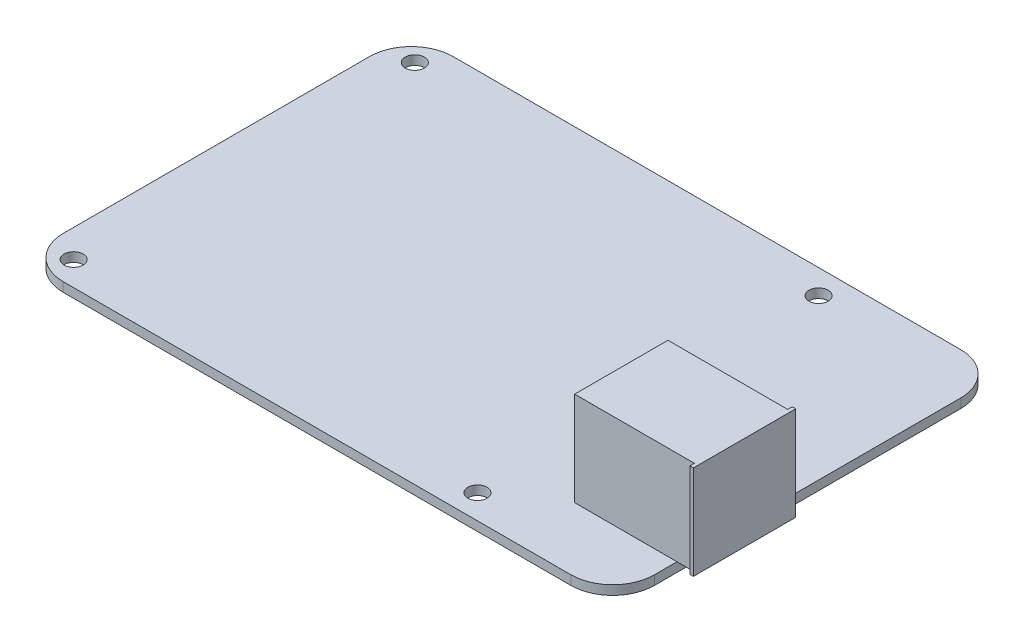
ISO-10303-21;
HEADER;
FILE_DESCRIPTION(('STEP AP214'),'2;1');
FILE_NAME('part.step','',(''),(''),'','','');
FILE_SCHEMA(('AUTOMOTIVE_DESIGN { 1 0 10303 214 1 1 1 1 }'));
ENDSEC;
DATA;
#1=APPLICATION_CONTEXT('core data for automotive mechanical design processes');
#2=APPLICATION_PROTOCOL_DEFINITION('international standard','automotive_design',2000,#1);
#3=PRODUCT_CONTEXT('',#1,'mechanical');
#4=PRODUCT('Part','Part','',(#3));
#5=PRODUCT_RELATED_PRODUCT_CATEGORY('part','',(#4));
#6=PRODUCT_DEFINITION_FORMATION('','',#4);
#7=PRODUCT_DEFINITION_CONTEXT('part definition',#1,'design');
#8=PRODUCT_DEFINITION('design','',#6,#7);
#9=PRODUCT_DEFINITION_SHAPE('','',#8);
#10=(LENGTH_UNIT() NAMED_UNIT(*) SI_UNIT(.MILLI.,.METRE.));
#11=(NAMED_UNIT(*) PLANE_ANGLE_UNIT() SI_UNIT($,.RADIAN.));
#12=(NAMED_UNIT(*) SI_UNIT($,.STERADIAN.) SOLID_ANGLE_UNIT());
#13=UNCERTAINTY_MEASURE_WITH_UNIT(LENGTH_MEASURE(1.E-05),#10,'distance_accuracy_value','');
#14=(GEOMETRIC_REPRESENTATION_CONTEXT(3) GLOBAL_UNCERTAINTY_ASSIGNED_CONTEXT((#13)) GLOBAL_UNIT_ASSIGNED_CONTEXT((#10,
#11,#12)) REPRESENTATION_CONTEXT('',''));
#15=CARTESIAN_POINT('',(0.,0.,0.));
#16=DIRECTION('',(0.,0.,1.));
#17=DIRECTION('',(1.,0.,0.));
#18=AXIS2_PLACEMENT_3D('',#15,#16,#17);
#19=CARTESIAN_POINT('',(42.46,1.33,-28.));
#20=DIRECTION('',(-1.,0.,0.));
#21=DIRECTION('',(0.,0.,1.));
#22=AXIS2_PLACEMENT_3D('',#19,#20,#21);
#23=PLANE('',#22);
#24=DIRECTION('',(0.,0.,-1.));
#25=VECTOR('',#24,1.);
#26=CARTESIAN_POINT('',(42.46,0.,-28.));
#27=LINE('',#26,#25);
#28=CARTESIAN_POINT('',(42.46,0.,22.));
#29=VERTEX_POINT('',#28);
#30=CARTESIAN_POINT('',(42.46,0.,-22.));
#31=VERTEX_POINT('',#30);
#32=EDGE_CURVE('E205',#29,#31,#27,.T.);
#33=ORIENTED_EDGE('',*,*,#32,.T.);
#34=DIRECTION('',(0.,-1.,0.));
#35=VECTOR('',#34,1.);
#36=CARTESIAN_POINT('',(42.46,1.33,-22.));
#37=LINE('',#36,#35);
#38=CARTESIAN_POINT('',(42.46,1.33,-22.));
#39=VERTEX_POINT('',#38);
#40=EDGE_CURVE('E248',#31,#39,#37,.F.);
#41=ORIENTED_EDGE('',*,*,#40,.T.);
#42=DIRECTION('',(0.,0.,-1.));
#43=VECTOR('',#42,1.);
#44=CARTESIAN_POINT('',(42.46,1.33,-28.));
#45=LINE('',#44,#43);
#46=CARTESIAN_POINT('',(42.46,1.33,5.36205839241151));
#47=VERTEX_POINT('',#46);
#48=EDGE_CURVE('E212',#47,#39,#45,.T.);
#49=ORIENTED_EDGE('',*,*,#48,.F.);
#50=CARTESIAN_POINT('',(42.46,1.33,18.7620583924115));
#51=VERTEX_POINT('',#50);
#52=EDGE_CURVE('E211',#51,#47,#45,.T.);
#53=ORIENTED_EDGE('',*,*,#52,.F.);
#54=CARTESIAN_POINT('',(42.46,1.33,22.));
#55=VERTEX_POINT('',#54);
#56=EDGE_CURVE('E208',#55,#51,#45,.T.);
#57=ORIENTED_EDGE('',*,*,#56,.F.);
#58=DIRECTION('',(0.,-1.,0.));
#59=VECTOR('',#58,1.);
#60=CARTESIAN_POINT('',(42.46,1.33,22.));
#61=LINE('',#60,#59);
#62=EDGE_CURVE('E245',#55,#29,#61,.T.);
#63=ORIENTED_EDGE('',*,*,#62,.T.);
#64=EDGE_LOOP('',(#33,#41,#49,#53,#57,#63));
#65=FACE_BOUND('',#64,.T.);
#66=ADVANCED_FACE('F33',(#65),#23,.F.);
#67=CARTESIAN_POINT('',(-42.46,1.33,-28.));
#68=DIRECTION('',(0.,0.,1.));
#69=DIRECTION('',(1.,0.,0.));
#70=AXIS2_PLACEMENT_3D('',#67,#68,#69);
#71=PLANE('',#70);
#72=DIRECTION('',(-1.,0.,0.));
#73=VECTOR('',#72,1.);
#74=CARTESIAN_POINT('',(-42.46,1.33,-28.));
#75=LINE('',#74,#73);
#76=CARTESIAN_POINT('',(36.46,1.33,-28.));
#77=VERTEX_POINT('',#76);
#78=CARTESIAN_POINT('',(-36.46,1.33,-28.));
#79=VERTEX_POINT('',#78);
#80=EDGE_CURVE('E210',#77,#79,#75,.T.);
#81=ORIENTED_EDGE('',*,*,#80,.F.);
#82=DIRECTION('',(0.,-1.,0.));
#83=VECTOR('',#82,1.);
#84=CARTESIAN_POINT('',(36.46,1.33,-28.));
#85=LINE('',#84,#83);
#86=CARTESIAN_POINT('',(36.46,0.,-28.));
#87=VERTEX_POINT('',#86);
#88=EDGE_CURVE('E234',#77,#87,#85,.T.);
#89=ORIENTED_EDGE('',*,*,#88,.T.);
#90=DIRECTION('',(-1.,0.,0.));
#91=VECTOR('',#90,1.);
#92=CARTESIAN_POINT('',(-42.46,0.,-28.));
#93=LINE('',#92,#91);
#94=CARTESIAN_POINT('',(-36.46,0.,-28.));
#95=VERTEX_POINT('',#94);
#96=EDGE_CURVE('E224',#87,#95,#93,.T.);
#97=ORIENTED_EDGE('',*,*,#96,.T.);
#98=DIRECTION('',(0.,-1.,0.));
#99=VECTOR('',#98,1.);
#100=CARTESIAN_POINT('',(-36.46,1.33,-28.));
#101=LINE('',#100,#99);
#102=EDGE_CURVE('E221',#95,#79,#101,.F.);
#103=ORIENTED_EDGE('',*,*,#102,.T.);
#104=EDGE_LOOP('',(#81,#89,#97,#103));
#105=FACE_BOUND('',#104,.T.);
#106=ADVANCED_FACE('F300',(#105),#71,.F.);
#107=CARTESIAN_POINT('',(-42.46,1.33,-28.));
#108=DIRECTION('',(1.,0.,0.));
#109=DIRECTION('',(0.,0.,-1.));
#110=AXIS2_PLACEMENT_3D('',#107,#108,#109);
#111=PLANE('',#110);
#112=DIRECTION('',(0.,0.,1.));
#113=VECTOR('',#112,1.);
#114=CARTESIAN_POINT('',(-42.46,1.33,-28.));
#115=LINE('',#114,#113);
#116=CARTESIAN_POINT('',(-42.46,1.33,-22.));
#117=VERTEX_POINT('',#116);
#118=CARTESIAN_POINT('',(-42.46,1.33,22.));
#119=VERTEX_POINT('',#118);
#120=EDGE_CURVE('E215',#117,#119,#115,.T.);
#121=ORIENTED_EDGE('',*,*,#120,.F.);
#122=DIRECTION('',(0.,-1.,0.));
#123=VECTOR('',#122,1.);
#124=CARTESIAN_POINT('',(-42.46,1.33,-22.));
#125=LINE('',#124,#123);
#126=CARTESIAN_POINT('',(-42.46,0.,-22.));
#127=VERTEX_POINT('',#126);
#128=EDGE_CURVE('E37',#117,#127,#125,.T.);
#129=ORIENTED_EDGE('',*,*,#128,.T.);
#130=DIRECTION('',(0.,0.,1.));
#131=VECTOR('',#130,1.);
#132=CARTESIAN_POINT('',(-42.46,0.,-28.));
#133=LINE('',#132,#131);
#134=CARTESIAN_POINT('',(-42.46,0.,22.));
#135=VERTEX_POINT('',#134);
#136=EDGE_CURVE('E227',#127,#135,#133,.T.);
#137=ORIENTED_EDGE('',*,*,#136,.T.);
#138=DIRECTION('',(0.,-1.,0.));
#139=VECTOR('',#138,1.);
#140=CARTESIAN_POINT('',(-42.46,1.33,22.));
#141=LINE('',#140,#139);
#142=EDGE_CURVE('E263',#135,#119,#141,.F.);
#143=ORIENTED_EDGE('',*,*,#142,.T.);
#144=EDGE_LOOP('',(#121,#129,#137,#143));
#145=FACE_BOUND('',#144,.T.);
#146=ADVANCED_FACE('F270',(#145),#111,.F.);
#147=CARTESIAN_POINT('',(-42.46,1.33,28.));
#148=DIRECTION('',(0.,0.,-1.));
#149=DIRECTION('',(-1.,0.,0.));
#150=AXIS2_PLACEMENT_3D('',#147,#148,#149);
#151=PLANE('',#150);
#152=DIRECTION('',(1.,0.,0.));
#153=VECTOR('',#152,1.);
#154=CARTESIAN_POINT('',(-42.46,0.,28.));
#155=LINE('',#154,#153);
#156=CARTESIAN_POINT('',(-36.46,0.,28.));
#157=VERTEX_POINT('',#156);
#158=CARTESIAN_POINT('',(36.46,0.,28.));
#159=VERTEX_POINT('',#158);
#160=EDGE_CURVE('E230',#157,#159,#155,.T.);
#161=ORIENTED_EDGE('',*,*,#160,.T.);
#162=DIRECTION('',(0.,-1.,0.));
#163=VECTOR('',#162,1.);
#164=CARTESIAN_POINT('',(36.46,1.33,28.));
#165=LINE('',#164,#163);
#166=CARTESIAN_POINT('',(36.46,1.33,28.));
#167=VERTEX_POINT('',#166);
#168=EDGE_CURVE('E262',#159,#167,#165,.F.);
#169=ORIENTED_EDGE('',*,*,#168,.T.);
#170=DIRECTION('',(1.,0.,0.));
#171=VECTOR('',#170,1.);
#172=CARTESIAN_POINT('',(-42.46,1.33,28.));
#173=LINE('',#172,#171);
#174=CARTESIAN_POINT('',(-36.46,1.33,28.));
#175=VERTEX_POINT('',#174);
#176=EDGE_CURVE('E218',#175,#167,#173,.T.);
#177=ORIENTED_EDGE('',*,*,#176,.F.);
#178=DIRECTION('',(0.,-1.,0.));
#179=VECTOR('',#178,1.);
#180=CARTESIAN_POINT('',(-36.46,1.33,28.));
#181=LINE('',#180,#179);
#182=EDGE_CURVE('E259',#175,#157,#181,.T.);
#183=ORIENTED_EDGE('',*,*,#182,.T.);
#184=EDGE_LOOP('',(#161,#169,#177,#183));
#185=FACE_BOUND('',#184,.T.);
#186=ADVANCED_FACE('F282',(#185),#151,.F.);
#187=CARTESIAN_POINT('',(0.,1.33,0.));
#188=DIRECTION('',(0.,1.,0.));
#189=DIRECTION('',(0.,0.,1.));
#190=AXIS2_PLACEMENT_3D('',#187,#188,#189);
#191=PLANE('',#190);
#192=DIRECTION('',(1.,0.,0.));
#193=VECTOR('',#192,1.);
#194=CARTESIAN_POINT('',(27.76,1.33,18.7620583924115));
#195=LINE('',#194,#193);
#196=CARTESIAN_POINT('',(27.76,1.33,18.7620583924115));
#197=VERTEX_POINT('',#196);
#198=EDGE_CURVE('E50',#197,#51,#195,.T.);
#199=ORIENTED_EDGE('',*,*,#198,.F.);
#200=DIRECTION('',(0.,0.,1.));
#201=VECTOR('',#200,1.);
#202=CARTESIAN_POINT('',(27.76,1.33,5.36205839241152));
#203=LINE('',#202,#201);
#204=CARTESIAN_POINT('',(27.76,1.33,5.36205839241152));
#205=VERTEX_POINT('',#204);
#206=EDGE_CURVE('E537',#205,#197,#203,.T.);
#207=ORIENTED_EDGE('',*,*,#206,.F.);
#208=DIRECTION('',(-1.,0.,0.));
#209=VECTOR('',#208,1.);
#210=CARTESIAN_POINT('',(27.76,1.33,5.36205839241152));
#211=LINE('',#210,#209);
#212=EDGE_CURVE('E11',#47,#205,#211,.T.);
#213=ORIENTED_EDGE('',*,*,#212,.F.);
#214=ORIENTED_EDGE('',*,*,#48,.T.);
#215=CARTESIAN_POINT('',(36.46,1.33,-22.));
#216=DIRECTION('',(0.,1.,0.));
#217=DIRECTION('',(0.,0.,1.));
#218=AXIS2_PLACEMENT_3D('',#215,#216,#217);
#219=CIRCLE('',#218,6.);
#220=EDGE_CURVE('E257',#39,#77,#219,.T.);
#221=ORIENTED_EDGE('',*,*,#220,.T.);
#222=ORIENTED_EDGE('',*,*,#80,.T.);
#223=CARTESIAN_POINT('',(-36.46,1.33,-22.));
#224=DIRECTION('',(0.,1.,0.));
#225=DIRECTION('',(0.,0.,1.));
#226=AXIS2_PLACEMENT_3D('',#223,#224,#225);
#227=CIRCLE('',#226,6.);
#228=EDGE_CURVE('E253',#79,#117,#227,.T.);
#229=ORIENTED_EDGE('',*,*,#228,.T.);
#230=ORIENTED_EDGE('',*,*,#120,.T.);
#231=CARTESIAN_POINT('',(-36.46,1.33,22.));
#232=DIRECTION('',(0.,1.,0.));
#233=DIRECTION('',(0.,0.,1.));
#234=AXIS2_PLACEMENT_3D('',#231,#232,#233);
#235=CIRCLE('',#234,6.);
#236=EDGE_CURVE('E251',#119,#175,#235,.T.);
#237=ORIENTED_EDGE('',*,*,#236,.T.);
#238=ORIENTED_EDGE('',*,*,#176,.T.);
#239=CARTESIAN_POINT('',(36.46,1.33,22.));
#240=DIRECTION('',(0.,1.,0.));
#241=DIRECTION('',(0.,0.,1.));
#242=AXIS2_PLACEMENT_3D('',#239,#240,#241);
#243=CIRCLE('',#242,6.);
#244=EDGE_CURVE('E255',#167,#55,#243,.T.);
#245=ORIENTED_EDGE('',*,*,#244,.T.);
#246=ORIENTED_EDGE('',*,*,#56,.T.);
#247=EDGE_LOOP('',(#199,#207,#213,#214,#221,#222,#229,#230,#237,#238,#245,#246));
#248=FACE_BOUND('',#247,.T.);
#249=CARTESIAN_POINT('',(19.54,1.33,-24.5));
#250=DIRECTION('',(0.,1.,0.));
#251=DIRECTION('',(0.,0.,1.));
#252=AXIS2_PLACEMENT_3D('',#249,#250,#251);
#253=CIRCLE('',#252,1.375);
#254=CARTESIAN_POINT('',(19.54,1.33,-23.125));
#255=VERTEX_POINT('',#254);
#256=EDGE_CURVE('E178',#255,#255,#253,.T.);
#257=ORIENTED_EDGE('',*,*,#256,.F.);
#258=EDGE_LOOP('',(#257));
#259=FACE_BOUND('',#258,.T.);
#260=CARTESIAN_POINT('',(19.54,1.33,24.5));
#261=DIRECTION('',(0.,1.,0.));
#262=DIRECTION('',(0.,0.,1.));
#263=AXIS2_PLACEMENT_3D('',#260,#261,#262);
#264=CIRCLE('',#263,1.375);
#265=CARTESIAN_POINT('',(19.54,1.33,25.875));
#266=VERTEX_POINT('',#265);
#267=EDGE_CURVE('E188',#266,#266,#264,.T.);
#268=ORIENTED_EDGE('',*,*,#267,.F.);
#269=EDGE_LOOP('',(#268));
#270=FACE_BOUND('',#269,.T.);
#271=CARTESIAN_POINT('',(-38.46,1.33,24.5));
#272=DIRECTION('',(0.,1.,0.));
#273=DIRECTION('',(0.,0.,1.));
#274=AXIS2_PLACEMENT_3D('',#271,#272,#273);
#275=CIRCLE('',#274,1.375);
#276=CARTESIAN_POINT('',(-38.46,1.33,25.875));
#277=VERTEX_POINT('',#276);
#278=EDGE_CURVE('E193',#277,#277,#275,.T.);
#279=ORIENTED_EDGE('',*,*,#278,.F.);
#280=EDGE_LOOP('',(#279));
#281=FACE_BOUND('',#280,.T.);
#282=CARTESIAN_POINT('',(-38.46,1.33,-24.5));
#283=DIRECTION('',(0.,1.,0.));
#284=DIRECTION('',(0.,0.,1.));
#285=AXIS2_PLACEMENT_3D('',#282,#283,#284);
#286=CIRCLE('',#285,1.375);
#287=CARTESIAN_POINT('',(-38.46,1.33,-23.125));
#288=VERTEX_POINT('',#287);
#289=EDGE_CURVE('E199',#288,#288,#286,.T.);
#290=ORIENTED_EDGE('',*,*,#289,.F.);
#291=EDGE_LOOP('',(#290));
#292=FACE_BOUND('',#291,.T.);
#293=ADVANCED_FACE('F285',(#248,#259,#270,#281,#292),#191,.T.);
#294=CARTESIAN_POINT('',(0.,0.,0.));
#295=DIRECTION('',(0.,1.,0.));
#296=DIRECTION('',(0.,0.,1.));
#297=AXIS2_PLACEMENT_3D('',#294,#295,#296);
#298=PLANE('',#297);
#299=CARTESIAN_POINT('',(19.54,0.,-24.5));
#300=DIRECTION('',(0.,1.,0.));
#301=DIRECTION('',(0.,0.,1.));
#302=AXIS2_PLACEMENT_3D('',#299,#300,#301);
#303=CIRCLE('',#302,1.375);
#304=CARTESIAN_POINT('',(19.54,0.,-23.125));
#305=VERTEX_POINT('',#304);
#306=EDGE_CURVE('E181',#305,#305,#303,.T.);
#307=ORIENTED_EDGE('',*,*,#306,.T.);
#308=EDGE_LOOP('',(#307));
#309=FACE_BOUND('',#308,.T.);
#310=CARTESIAN_POINT('',(19.54,0.,24.5));
#311=DIRECTION('',(0.,1.,0.));
#312=DIRECTION('',(0.,0.,1.));
#313=AXIS2_PLACEMENT_3D('',#310,#311,#312);
#314=CIRCLE('',#313,1.375);
#315=CARTESIAN_POINT('',(19.54,0.,25.875));
#316=VERTEX_POINT('',#315);
#317=EDGE_CURVE('E190',#316,#316,#314,.T.);
#318=ORIENTED_EDGE('',*,*,#317,.T.);
#319=EDGE_LOOP('',(#318));
#320=FACE_BOUND('',#319,.T.);
#321=CARTESIAN_POINT('',(-38.46,0.,24.5));
#322=DIRECTION('',(0.,1.,0.));
#323=DIRECTION('',(0.,0.,1.));
#324=AXIS2_PLACEMENT_3D('',#321,#322,#323);
#325=CIRCLE('',#324,1.375);
#326=CARTESIAN_POINT('',(-38.46,0.,25.875));
#327=VERTEX_POINT('',#326);
#328=EDGE_CURVE('E196',#327,#327,#325,.T.);
#329=ORIENTED_EDGE('',*,*,#328,.T.);
#330=EDGE_LOOP('',(#329));
#331=FACE_BOUND('',#330,.T.);
#332=CARTESIAN_POINT('',(-38.46,0.,-24.5));
#333=DIRECTION('',(0.,1.,0.));
#334=DIRECTION('',(0.,0.,1.));
#335=AXIS2_PLACEMENT_3D('',#332,#333,#334);
#336=CIRCLE('',#335,1.375);
#337=CARTESIAN_POINT('',(-38.46,0.,-23.125));
#338=VERTEX_POINT('',#337);
#339=EDGE_CURVE('E202',#338,#338,#336,.T.);
#340=ORIENTED_EDGE('',*,*,#339,.T.);
#341=EDGE_LOOP('',(#340));
#342=FACE_BOUND('',#341,.T.);
#343=ORIENTED_EDGE('',*,*,#96,.F.);
#344=CARTESIAN_POINT('',(36.46,0.,-22.));
#345=DIRECTION('',(0.,1.,0.));
#346=DIRECTION('',(0.,0.,1.));
#347=AXIS2_PLACEMENT_3D('',#344,#345,#346);
#348=CIRCLE('',#347,6.);
#349=EDGE_CURVE('E243',#87,#31,#348,.F.);
#350=ORIENTED_EDGE('',*,*,#349,.T.);
#351=ORIENTED_EDGE('',*,*,#32,.F.);
#352=CARTESIAN_POINT('',(36.46,0.,22.));
#353=DIRECTION('',(0.,1.,0.));
#354=DIRECTION('',(0.,0.,1.));
#355=AXIS2_PLACEMENT_3D('',#352,#353,#354);
#356=CIRCLE('',#355,6.);
#357=EDGE_CURVE('E241',#29,#159,#356,.F.);
#358=ORIENTED_EDGE('',*,*,#357,.T.);
#359=ORIENTED_EDGE('',*,*,#160,.F.);
#360=CARTESIAN_POINT('',(-36.46,0.,22.));
#361=DIRECTION('',(0.,1.,0.));
#362=DIRECTION('',(0.,0.,1.));
#363=AXIS2_PLACEMENT_3D('',#360,#361,#362);
#364=CIRCLE('',#363,6.);
#365=EDGE_CURVE('E237',#157,#135,#364,.F.);
#366=ORIENTED_EDGE('',*,*,#365,.T.);
#367=ORIENTED_EDGE('',*,*,#136,.F.);
#368=CARTESIAN_POINT('',(-36.46,0.,-22.));
#369=DIRECTION('',(0.,1.,0.));
#370=DIRECTION('',(0.,0.,1.));
#371=AXIS2_PLACEMENT_3D('',#368,#369,#370);
#372=CIRCLE('',#371,6.);
#373=EDGE_CURVE('E239',#127,#95,#372,.F.);
#374=ORIENTED_EDGE('',*,*,#373,.T.);
#375=EDGE_LOOP('',(#343,#350,#351,#358,#359,#366,#367,#374));
#376=FACE_BOUND('',#375,.T.);
#377=ADVANCED_FACE('F275',(#309,#320,#331,#342,#376),#298,.F.);
#378=CARTESIAN_POINT('',(36.46,1.33,-22.));
#379=DIRECTION('',(0.,-1.,0.));
#380=DIRECTION('',(0.,0.,-1.));
#381=AXIS2_PLACEMENT_3D('',#378,#379,#380);
#382=CYLINDRICAL_SURFACE('',#381,6.);
#383=ORIENTED_EDGE('',*,*,#220,.F.);
#384=ORIENTED_EDGE('',*,*,#40,.F.);
#385=ORIENTED_EDGE('',*,*,#349,.F.);
#386=ORIENTED_EDGE('',*,*,#88,.F.);
#387=EDGE_LOOP('',(#383,#384,#385,#386));
#388=FACE_BOUND('',#387,.T.);
#389=ADVANCED_FACE('F297',(#388),#382,.T.);
#390=CARTESIAN_POINT('',(36.46,1.33,22.));
#391=DIRECTION('',(0.,-1.,0.));
#392=DIRECTION('',(0.,0.,-1.));
#393=AXIS2_PLACEMENT_3D('',#390,#391,#392);
#394=CYLINDRICAL_SURFACE('',#393,6.);
#395=ORIENTED_EDGE('',*,*,#244,.F.);
#396=ORIENTED_EDGE('',*,*,#168,.F.);
#397=ORIENTED_EDGE('',*,*,#357,.F.);
#398=ORIENTED_EDGE('',*,*,#62,.F.);
#399=EDGE_LOOP('',(#395,#396,#397,#398));
#400=FACE_BOUND('',#399,.T.);
#401=ADVANCED_FACE('F290',(#400),#394,.T.);
#402=CARTESIAN_POINT('',(-36.46,1.33,-22.));
#403=DIRECTION('',(0.,-1.,0.));
#404=DIRECTION('',(0.,0.,-1.));
#405=AXIS2_PLACEMENT_3D('',#402,#403,#404);
#406=CYLINDRICAL_SURFACE('',#405,6.);
#407=ORIENTED_EDGE('',*,*,#228,.F.);
#408=ORIENTED_EDGE('',*,*,#102,.F.);
#409=ORIENTED_EDGE('',*,*,#373,.F.);
#410=ORIENTED_EDGE('',*,*,#128,.F.);
#411=EDGE_LOOP('',(#407,#408,#409,#410));
#412=FACE_BOUND('',#411,.T.);
#413=ADVANCED_FACE('F302',(#412),#406,.T.);
#414=CARTESIAN_POINT('',(-36.46,1.33,22.));
#415=DIRECTION('',(0.,-1.,0.));
#416=DIRECTION('',(0.,0.,-1.));
#417=AXIS2_PLACEMENT_3D('',#414,#415,#416);
#418=CYLINDRICAL_SURFACE('',#417,6.);
#419=ORIENTED_EDGE('',*,*,#236,.F.);
#420=ORIENTED_EDGE('',*,*,#142,.F.);
#421=ORIENTED_EDGE('',*,*,#365,.F.);
#422=ORIENTED_EDGE('',*,*,#182,.F.);
#423=EDGE_LOOP('',(#419,#420,#421,#422));
#424=FACE_BOUND('',#423,.T.);
#425=ADVANCED_FACE('F35',(#424),#418,.T.);
#426=CARTESIAN_POINT('',(-38.46,0.,-24.5));
#427=DIRECTION('',(0.,1.,0.));
#428=DIRECTION('',(0.,0.,1.));
#429=AXIS2_PLACEMENT_3D('',#426,#427,#428);
#430=CYLINDRICAL_SURFACE('',#429,1.375);
#431=ORIENTED_EDGE('',*,*,#339,.F.);
#432=EDGE_LOOP('',(#431));
#433=FACE_BOUND('',#432,.T.);
#434=ORIENTED_EDGE('',*,*,#289,.T.);
#435=EDGE_LOOP('',(#434));
#436=FACE_BOUND('',#435,.T.);
#437=ADVANCED_FACE('F308',(#433,#436),#430,.F.);
#438=CARTESIAN_POINT('',(-38.46,0.,24.5));
#439=DIRECTION('',(0.,1.,0.));
#440=DIRECTION('',(0.,0.,1.));
#441=AXIS2_PLACEMENT_3D('',#438,#439,#440);
#442=CYLINDRICAL_SURFACE('',#441,1.375);
#443=ORIENTED_EDGE('',*,*,#328,.F.);
#444=EDGE_LOOP('',(#443));
#445=FACE_BOUND('',#444,.T.);
#446=ORIENTED_EDGE('',*,*,#278,.T.);
#447=EDGE_LOOP('',(#446));
#448=FACE_BOUND('',#447,.T.);
#449=ADVANCED_FACE('F458',(#445,#448),#442,.F.);
#450=CARTESIAN_POINT('',(19.54,0.,24.5));
#451=DIRECTION('',(0.,1.,0.));
#452=DIRECTION('',(0.,0.,1.));
#453=AXIS2_PLACEMENT_3D('',#450,#451,#452);
#454=CYLINDRICAL_SURFACE('',#453,1.375);
#455=ORIENTED_EDGE('',*,*,#317,.F.);
#456=EDGE_LOOP('',(#455));
#457=FACE_BOUND('',#456,.T.);
#458=ORIENTED_EDGE('',*,*,#267,.T.);
#459=EDGE_LOOP('',(#458));
#460=FACE_BOUND('',#459,.T.);
#461=ADVANCED_FACE('F454',(#457,#460),#454,.F.);
#462=CARTESIAN_POINT('',(19.54,0.,-24.5));
#463=DIRECTION('',(0.,1.,0.));
#464=DIRECTION('',(0.,0.,1.));
#465=AXIS2_PLACEMENT_3D('',#462,#463,#464);
#466=CYLINDRICAL_SURFACE('',#465,1.375);
#467=ORIENTED_EDGE('',*,*,#306,.F.);
#468=EDGE_LOOP('',(#467));
#469=FACE_BOUND('',#468,.T.);
#470=ORIENTED_EDGE('',*,*,#256,.T.);
#471=EDGE_LOOP('',(#470));
#472=FACE_BOUND('',#471,.T.);
#473=ADVANCED_FACE('F359',(#469,#472),#466,.F.);
#474=CARTESIAN_POINT('',(0.,1.33,0.));
#475=DIRECTION('',(0.,1.,0.));
#476=DIRECTION('',(0.,0.,1.));
#477=AXIS2_PLACEMENT_3D('',#474,#475,#476);
#478=PLANE('',#477);
#479=CARTESIAN_POINT('',(44.96,1.33,18.7620583924115));
#480=VERTEX_POINT('',#479);
#481=EDGE_CURVE('E542',#51,#480,#195,.T.);
#482=ORIENTED_EDGE('',*,*,#481,.F.);
#483=ORIENTED_EDGE('',*,*,#52,.T.);
#484=CARTESIAN_POINT('',(44.96,1.33,5.36205839241152));
#485=VERTEX_POINT('',#484);
#486=EDGE_CURVE('E43',#485,#47,#211,.T.);
#487=ORIENTED_EDGE('',*,*,#486,.F.);
#488=DIRECTION('',(0.,0.,1.));
#489=VECTOR('',#488,1.);
#490=CARTESIAN_POINT('',(44.96,1.33,4.71205839241152));
#491=LINE('',#490,#489);
#492=CARTESIAN_POINT('',(44.96,1.33,4.71205839241152));
#493=VERTEX_POINT('',#492);
#494=EDGE_CURVE('E177',#493,#485,#491,.T.);
#495=ORIENTED_EDGE('',*,*,#494,.F.);
#496=DIRECTION('',(-1.,0.,0.));
#497=VECTOR('',#496,1.);
#498=CARTESIAN_POINT('',(44.96,1.33,4.71205839241152));
#499=LINE('',#498,#497);
#500=CARTESIAN_POINT('',(45.46,1.33,4.71205839241152));
#501=VERTEX_POINT('',#500);
#502=EDGE_CURVE('E173',#501,#493,#499,.T.);
#503=ORIENTED_EDGE('',*,*,#502,.F.);
#504=DIRECTION('',(0.,0.,-1.));
#505=VECTOR('',#504,1.);
#506=CARTESIAN_POINT('',(45.46,1.33,4.71205839241152));
#507=LINE('',#506,#505);
#508=CARTESIAN_POINT('',(45.46,1.33,19.4120583924115));
#509=VERTEX_POINT('',#508);
#510=EDGE_CURVE('E531',#509,#501,#507,.T.);
#511=ORIENTED_EDGE('',*,*,#510,.F.);
#512=DIRECTION('',(1.,0.,0.));
#513=VECTOR('',#512,1.);
#514=CARTESIAN_POINT('',(44.96,1.33,19.4120583924115));
#515=LINE('',#514,#513);
#516=CARTESIAN_POINT('',(44.96,1.33,19.4120583924115));
#517=VERTEX_POINT('',#516);
#518=EDGE_CURVE('E546',#517,#509,#515,.T.);
#519=ORIENTED_EDGE('',*,*,#518,.F.);
#520=DIRECTION('',(0.,0.,1.));
#521=VECTOR('',#520,1.);
#522=CARTESIAN_POINT('',(44.96,1.33,18.7620583924115));
#523=LINE('',#522,#521);
#524=EDGE_CURVE('E544',#480,#517,#523,.T.);
#525=ORIENTED_EDGE('',*,*,#524,.F.);
#526=EDGE_LOOP('',(#482,#483,#487,#495,#503,#511,#519,#525));
#527=FACE_BOUND('',#526,.T.);
#528=ADVANCED_FACE('F354',(#527),#478,.F.);
#529=CARTESIAN_POINT('',(44.96,14.83,4.71205839241152));
#530=DIRECTION('',(1.,0.,0.));
#531=DIRECTION('',(0.,0.,-1.));
#532=AXIS2_PLACEMENT_3D('',#529,#530,#531);
#533=PLANE('',#532);
#534=ORIENTED_EDGE('',*,*,#494,.T.);
#535=DIRECTION('',(0.,-1.,0.));
#536=VECTOR('',#535,1.);
#537=CARTESIAN_POINT('',(44.96,14.83,5.36205839241152));
#538=LINE('',#537,#536);
#539=CARTESIAN_POINT('',(44.96,14.83,5.36205839241152));
#540=VERTEX_POINT('',#539);
#541=EDGE_CURVE('E157',#540,#485,#538,.T.);
#542=ORIENTED_EDGE('',*,*,#541,.F.);
#543=DIRECTION('',(0.,0.,1.));
#544=VECTOR('',#543,1.);
#545=CARTESIAN_POINT('',(44.96,14.83,4.71205839241152));
#546=LINE('',#545,#544);
#547=CARTESIAN_POINT('',(44.96,14.83,4.71205839241152));
#548=VERTEX_POINT('',#547);
#549=EDGE_CURVE('E164',#548,#540,#546,.T.);
#550=ORIENTED_EDGE('',*,*,#549,.F.);
#551=DIRECTION('',(0.,-1.,0.));
#552=VECTOR('',#551,1.);
#553=CARTESIAN_POINT('',(44.96,14.83,4.71205839241152));
#554=LINE('',#553,#552);
#555=EDGE_CURVE('E528',#548,#493,#554,.T.);
#556=ORIENTED_EDGE('',*,*,#555,.T.);
#557=EDGE_LOOP('',(#534,#542,#550,#556));
#558=FACE_BOUND('',#557,.T.);
#559=ADVANCED_FACE('F175',(#558),#533,.F.);
#560=CARTESIAN_POINT('',(27.76,14.83,5.36205839241152));
#561=DIRECTION('',(0.,0.,1.));
#562=DIRECTION('',(1.,0.,0.));
#563=AXIS2_PLACEMENT_3D('',#560,#561,#562);
#564=PLANE('',#563);
#565=ORIENTED_EDGE('',*,*,#486,.T.);
#566=ORIENTED_EDGE('',*,*,#212,.T.);
#567=DIRECTION('',(0.,-1.,0.));
#568=VECTOR('',#567,1.);
#569=CARTESIAN_POINT('',(27.76,14.83,5.36205839241152));
#570=LINE('',#569,#568);
#571=CARTESIAN_POINT('',(27.76,14.83,5.36205839241152));
#572=VERTEX_POINT('',#571);
#573=EDGE_CURVE('E160',#572,#205,#570,.T.);
#574=ORIENTED_EDGE('',*,*,#573,.F.);
#575=DIRECTION('',(-1.,0.,0.));
#576=VECTOR('',#575,1.);
#577=CARTESIAN_POINT('',(27.76,14.83,5.36205839241152));
#578=LINE('',#577,#576);
#579=EDGE_CURVE('E152',#540,#572,#578,.T.);
#580=ORIENTED_EDGE('',*,*,#579,.F.);
#581=ORIENTED_EDGE('',*,*,#541,.T.);
#582=EDGE_LOOP('',(#565,#566,#574,#580,#581));
#583=FACE_BOUND('',#582,.T.);
#584=ADVANCED_FACE('F155',(#583),#564,.F.);
#585=CARTESIAN_POINT('',(27.76,14.83,5.36205839241152));
#586=DIRECTION('',(1.,0.,0.));
#587=DIRECTION('',(0.,0.,-1.));
#588=AXIS2_PLACEMENT_3D('',#585,#586,#587);
#589=PLANE('',#588);
#590=ORIENTED_EDGE('',*,*,#206,.T.);
#591=DIRECTION('',(0.,-1.,0.));
#592=VECTOR('',#591,1.);
#593=CARTESIAN_POINT('',(27.76,14.83,18.7620583924115));
#594=LINE('',#593,#592);
#595=CARTESIAN_POINT('',(27.76,14.83,18.7620583924115));
#596=VERTEX_POINT('',#595);
#597=EDGE_CURVE('E183',#596,#197,#594,.T.);
#598=ORIENTED_EDGE('',*,*,#597,.F.);
#599=DIRECTION('',(0.,0.,1.));
#600=VECTOR('',#599,1.);
#601=CARTESIAN_POINT('',(27.76,14.83,5.36205839241152));
#602=LINE('',#601,#600);
#603=EDGE_CURVE('E163',#572,#596,#602,.T.);
#604=ORIENTED_EDGE('',*,*,#603,.F.);
#605=ORIENTED_EDGE('',*,*,#573,.T.);
#606=EDGE_LOOP('',(#590,#598,#604,#605));
#607=FACE_BOUND('',#606,.T.);
#608=ADVANCED_FACE('F379',(#607),#589,.F.);
#609=CARTESIAN_POINT('',(27.76,14.83,18.7620583924115));
#610=DIRECTION('',(0.,0.,-1.));
#611=DIRECTION('',(-1.,0.,0.));
#612=AXIS2_PLACEMENT_3D('',#609,#610,#611);
#613=PLANE('',#612);
#614=ORIENTED_EDGE('',*,*,#198,.T.);
#615=ORIENTED_EDGE('',*,*,#481,.T.);
#616=DIRECTION('',(0.,-1.,0.));
#617=VECTOR('',#616,1.);
#618=CARTESIAN_POINT('',(44.96,14.83,18.7620583924115));
#619=LINE('',#618,#617);
#620=CARTESIAN_POINT('',(44.96,14.83,18.7620583924115));
#621=VERTEX_POINT('',#620);
#622=EDGE_CURVE('E557',#621,#480,#619,.T.);
#623=ORIENTED_EDGE('',*,*,#622,.F.);
#624=DIRECTION('',(1.,0.,0.));
#625=VECTOR('',#624,1.);
#626=CARTESIAN_POINT('',(27.76,14.83,18.7620583924115));
#627=LINE('',#626,#625);
#628=EDGE_CURVE('E563',#596,#621,#627,.T.);
#629=ORIENTED_EDGE('',*,*,#628,.F.);
#630=ORIENTED_EDGE('',*,*,#597,.T.);
#631=EDGE_LOOP('',(#614,#615,#623,#629,#630));
#632=FACE_BOUND('',#631,.T.);
#633=ADVANCED_FACE('F388',(#632),#613,.F.);
#634=CARTESIAN_POINT('',(44.96,14.83,18.7620583924115));
#635=DIRECTION('',(1.,0.,0.));
#636=DIRECTION('',(0.,0.,-1.));
#637=AXIS2_PLACEMENT_3D('',#634,#635,#636);
#638=PLANE('',#637);
#639=ORIENTED_EDGE('',*,*,#524,.T.);
#640=DIRECTION('',(0.,-1.,0.));
#641=VECTOR('',#640,1.);
#642=CARTESIAN_POINT('',(44.96,14.83,19.4120583924115));
#643=LINE('',#642,#641);
#644=CARTESIAN_POINT('',(44.96,14.83,19.4120583924115));
#645=VERTEX_POINT('',#644);
#646=EDGE_CURVE('E554',#645,#517,#643,.T.);
#647=ORIENTED_EDGE('',*,*,#646,.F.);
#648=DIRECTION('',(0.,0.,1.));
#649=VECTOR('',#648,1.);
#650=CARTESIAN_POINT('',(44.96,14.83,18.7620583924115));
#651=LINE('',#650,#649);
#652=EDGE_CURVE('E565',#621,#645,#651,.T.);
#653=ORIENTED_EDGE('',*,*,#652,.F.);
#654=ORIENTED_EDGE('',*,*,#622,.T.);
#655=EDGE_LOOP('',(#639,#647,#653,#654));
#656=FACE_BOUND('',#655,.T.);
#657=ADVANCED_FACE('F398',(#656),#638,.F.);
#658=CARTESIAN_POINT('',(44.96,14.83,19.4120583924115));
#659=DIRECTION('',(0.,0.,-1.));
#660=DIRECTION('',(-1.,0.,0.));
#661=AXIS2_PLACEMENT_3D('',#658,#659,#660);
#662=PLANE('',#661);
#663=ORIENTED_EDGE('',*,*,#518,.T.);
#664=DIRECTION('',(0.,-1.,0.));
#665=VECTOR('',#664,1.);
#666=CARTESIAN_POINT('',(45.46,14.83,19.4120583924115));
#667=LINE('',#666,#665);
#668=CARTESIAN_POINT('',(45.46,14.83,19.4120583924115));
#669=VERTEX_POINT('',#668);
#670=EDGE_CURVE('E551',#669,#509,#667,.T.);
#671=ORIENTED_EDGE('',*,*,#670,.F.);
#672=DIRECTION('',(1.,0.,0.));
#673=VECTOR('',#672,1.);
#674=CARTESIAN_POINT('',(44.96,14.83,19.4120583924115));
#675=LINE('',#674,#673);
#676=EDGE_CURVE('E569',#645,#669,#675,.T.);
#677=ORIENTED_EDGE('',*,*,#676,.F.);
#678=ORIENTED_EDGE('',*,*,#646,.T.);
#679=EDGE_LOOP('',(#663,#671,#677,#678));
#680=FACE_BOUND('',#679,.T.);
#681=ADVANCED_FACE('F408',(#680),#662,.F.);
#682=CARTESIAN_POINT('',(45.46,14.83,4.71205839241152));
#683=DIRECTION('',(-1.,0.,0.));
#684=DIRECTION('',(0.,0.,1.));
#685=AXIS2_PLACEMENT_3D('',#682,#683,#684);
#686=PLANE('',#685);
#687=ORIENTED_EDGE('',*,*,#510,.T.);
#688=DIRECTION('',(0.,-1.,0.));
#689=VECTOR('',#688,1.);
#690=CARTESIAN_POINT('',(45.46,14.83,4.71205839241152));
#691=LINE('',#690,#689);
#692=CARTESIAN_POINT('',(45.46,14.83,4.71205839241152));
#693=VERTEX_POINT('',#692);
#694=EDGE_CURVE('E530',#693,#501,#691,.T.);
#695=ORIENTED_EDGE('',*,*,#694,.F.);
#696=DIRECTION('',(0.,0.,-1.));
#697=VECTOR('',#696,1.);
#698=CARTESIAN_POINT('',(45.46,14.83,18.7620583924115));
#699=LINE('',#698,#697);
#700=EDGE_CURVE('E570',#669,#693,#699,.T.);
#701=ORIENTED_EDGE('',*,*,#700,.F.);
#702=ORIENTED_EDGE('',*,*,#670,.T.);
#703=EDGE_LOOP('',(#687,#695,#701,#702));
#704=FACE_BOUND('',#703,.T.);
#705=ADVANCED_FACE('F418',(#704),#686,.F.);
#706=CARTESIAN_POINT('',(44.96,14.83,4.71205839241152));
#707=DIRECTION('',(0.,0.,1.));
#708=DIRECTION('',(1.,0.,0.));
#709=AXIS2_PLACEMENT_3D('',#706,#707,#708);
#710=PLANE('',#709);
#711=ORIENTED_EDGE('',*,*,#502,.T.);
#712=ORIENTED_EDGE('',*,*,#555,.F.);
#713=DIRECTION('',(-1.,0.,0.));
#714=VECTOR('',#713,1.);
#715=CARTESIAN_POINT('',(44.96,14.83,4.71205839241152));
#716=LINE('',#715,#714);
#717=EDGE_CURVE('E169',#693,#548,#716,.T.);
#718=ORIENTED_EDGE('',*,*,#717,.F.);
#719=ORIENTED_EDGE('',*,*,#694,.T.);
#720=EDGE_LOOP('',(#711,#712,#718,#719));
#721=FACE_BOUND('',#720,.T.);
#722=ADVANCED_FACE('F429',(#721),#710,.F.);
#723=CARTESIAN_POINT('',(0.,14.83,0.));
#724=DIRECTION('',(0.,1.,0.));
#725=DIRECTION('',(0.,0.,1.));
#726=AXIS2_PLACEMENT_3D('',#723,#724,#725);
#727=PLANE('',#726);
#728=ORIENTED_EDGE('',*,*,#549,.T.);
#729=ORIENTED_EDGE('',*,*,#579,.T.);
#730=ORIENTED_EDGE('',*,*,#603,.T.);
#731=ORIENTED_EDGE('',*,*,#628,.T.);
#732=ORIENTED_EDGE('',*,*,#652,.T.);
#733=ORIENTED_EDGE('',*,*,#676,.T.);
#734=ORIENTED_EDGE('',*,*,#700,.T.);
#735=ORIENTED_EDGE('',*,*,#717,.T.);
#736=EDGE_LOOP('',(#728,#729,#730,#731,#732,#733,#734,#735));
#737=FACE_BOUND('',#736,.T.);
#738=ADVANCED_FACE('F167',(#737),#727,.T.);
#739=CLOSED_SHELL('',(#66,#106,#146,#186,#293,#377,#389,#401,#413,#425,#437,#449,#461,#473,#528,
#559,#584,#608,#633,#657,#681,#705,#722,#738));
#740=MANIFOLD_SOLID_BREP('B2',#739);
#741=ADVANCED_BREP_SHAPE_REPRESENTATION('',(#18,#740),#14);
#742=SHAPE_DEFINITION_REPRESENTATION(#9,#741);
ENDSEC;
END-ISO-10303-21;
